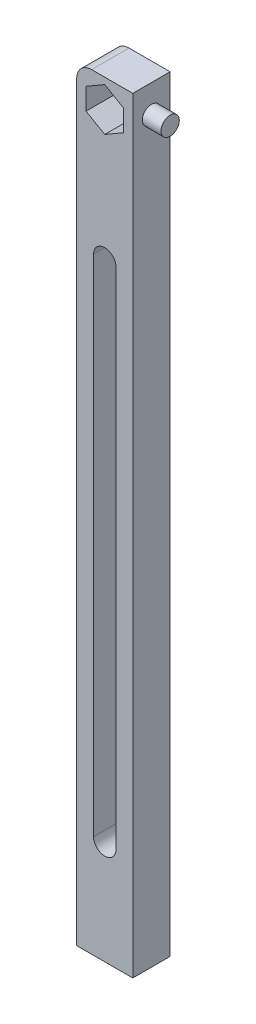
ISO-10303-21;
HEADER;
FILE_DESCRIPTION(('STEP AP214'),'2;1');
FILE_NAME('part.step','',(''),(''),'','','');
FILE_SCHEMA(('AUTOMOTIVE_DESIGN { 1 0 10303 214 1 1 1 1 }'));
ENDSEC;
DATA;
#1=APPLICATION_CONTEXT('core data for automotive mechanical design processes');
#2=APPLICATION_PROTOCOL_DEFINITION('international standard','automotive_design',2000,#1);
#3=PRODUCT_CONTEXT('',#1,'mechanical');
#4=PRODUCT('Part','Part','',(#3));
#5=PRODUCT_RELATED_PRODUCT_CATEGORY('part','',(#4));
#6=PRODUCT_DEFINITION_FORMATION('','',#4);
#7=PRODUCT_DEFINITION_CONTEXT('part definition',#1,'design');
#8=PRODUCT_DEFINITION('design','',#6,#7);
#9=PRODUCT_DEFINITION_SHAPE('','',#8);
#10=(LENGTH_UNIT() NAMED_UNIT(*) SI_UNIT(.MILLI.,.METRE.));
#11=(NAMED_UNIT(*) PLANE_ANGLE_UNIT() SI_UNIT($,.RADIAN.));
#12=(NAMED_UNIT(*) SI_UNIT($,.STERADIAN.) SOLID_ANGLE_UNIT());
#13=UNCERTAINTY_MEASURE_WITH_UNIT(LENGTH_MEASURE(1.E-05),#10,'distance_accuracy_value','');
#14=(GEOMETRIC_REPRESENTATION_CONTEXT(3) GLOBAL_UNCERTAINTY_ASSIGNED_CONTEXT((#13)) GLOBAL_UNIT_ASSIGNED_CONTEXT((#10,
#11,#12)) REPRESENTATION_CONTEXT('',''));
#15=CARTESIAN_POINT('',(0.,0.,0.));
#16=DIRECTION('',(0.,0.,1.));
#17=DIRECTION('',(1.,0.,0.));
#18=AXIS2_PLACEMENT_3D('',#15,#16,#17);
#19=CARTESIAN_POINT('',(0.,0.,10.));
#20=DIRECTION('',(0.,0.,1.));
#21=DIRECTION('',(1.,0.,0.));
#22=AXIS2_PLACEMENT_3D('',#19,#20,#21);
#23=PLANE('',#22);
#24=DIRECTION('',(-1.,0.,0.));
#25=VECTOR('',#24,1.);
#26=CARTESIAN_POINT('',(15.,-205.,10.));
#27=LINE('',#26,#25);
#28=CARTESIAN_POINT('',(15.,-205.,10.));
#29=VERTEX_POINT('',#28);
#30=CARTESIAN_POINT('',(0.,-205.,10.));
#31=VERTEX_POINT('',#30);
#32=EDGE_CURVE('E141',#29,#31,#27,.T.);
#33=ORIENTED_EDGE('',*,*,#32,.F.);
#34=DIRECTION('',(0.,-1.,0.));
#35=VECTOR('',#34,1.);
#36=CARTESIAN_POINT('',(15.,-15.,10.));
#37=LINE('',#36,#35);
#38=CARTESIAN_POINT('',(15.,0.,10.));
#39=VERTEX_POINT('',#38);
#40=EDGE_CURVE('E163',#39,#29,#37,.T.);
#41=ORIENTED_EDGE('',*,*,#40,.F.);
#42=DIRECTION('',(-1.,0.,0.));
#43=VECTOR('',#42,1.);
#44=CARTESIAN_POINT('',(0.,0.,10.));
#45=LINE('',#44,#43);
#46=CARTESIAN_POINT('',(4.,0.,10.));
#47=VERTEX_POINT('',#46);
#48=EDGE_CURVE('E170',#39,#47,#45,.T.);
#49=ORIENTED_EDGE('',*,*,#48,.T.);
#50=CARTESIAN_POINT('',(4.,-4.,10.));
#51=DIRECTION('',(0.,0.,1.));
#52=DIRECTION('',(1.,0.,0.));
#53=AXIS2_PLACEMENT_3D('',#50,#51,#52);
#54=CIRCLE('',#53,4.);
#55=CARTESIAN_POINT('',(0.,-4.,10.));
#56=VERTEX_POINT('',#55);
#57=EDGE_CURVE('E41',#47,#56,#54,.T.);
#58=ORIENTED_EDGE('',*,*,#57,.T.);
#59=DIRECTION('',(0.,-1.,0.));
#60=VECTOR('',#59,1.);
#61=CARTESIAN_POINT('',(0.,0.,10.));
#62=LINE('',#61,#60);
#63=EDGE_CURVE('E165',#56,#31,#62,.T.);
#64=ORIENTED_EDGE('',*,*,#63,.T.);
#65=EDGE_LOOP('',(#33,#41,#49,#58,#64));
#66=FACE_BOUND('',#65,.T.);
#67=CARTESIAN_POINT('',(7.49999999999998,-42.5,10.));
#68=DIRECTION('',(0.,0.,1.));
#69=DIRECTION('',(1.,0.,0.));
#70=AXIS2_PLACEMENT_3D('',#67,#68,#69);
#71=CIRCLE('',#70,3.);
#72=CARTESIAN_POINT('',(10.5,-42.5,10.));
#73=VERTEX_POINT('',#72);
#74=CARTESIAN_POINT('',(4.49999999999998,-42.5,10.));
#75=VERTEX_POINT('',#74);
#76=EDGE_CURVE('E56',#73,#75,#71,.T.);
#77=ORIENTED_EDGE('',*,*,#76,.F.);
#78=DIRECTION('',(0.,1.,0.));
#79=VECTOR('',#78,1.);
#80=CARTESIAN_POINT('',(10.5,-42.5,10.));
#81=LINE('',#80,#79);
#82=CARTESIAN_POINT('',(10.5,-177.5,10.));
#83=VERTEX_POINT('',#82);
#84=EDGE_CURVE('E199',#83,#73,#81,.T.);
#85=ORIENTED_EDGE('',*,*,#84,.F.);
#86=CARTESIAN_POINT('',(7.4999999999999,-177.5,10.));
#87=DIRECTION('',(0.,0.,1.));
#88=DIRECTION('',(1.,0.,0.));
#89=AXIS2_PLACEMENT_3D('',#86,#87,#88);
#90=CIRCLE('',#89,3.);
#91=CARTESIAN_POINT('',(4.4999999999999,-177.5,10.));
#92=VERTEX_POINT('',#91);
#93=EDGE_CURVE('E211',#92,#83,#90,.T.);
#94=ORIENTED_EDGE('',*,*,#93,.F.);
#95=DIRECTION('',(0.,-1.,0.));
#96=VECTOR('',#95,1.);
#97=CARTESIAN_POINT('',(4.49999999999998,-42.5,10.));
#98=LINE('',#97,#96);
#99=EDGE_CURVE('E189',#75,#92,#98,.T.);
#100=ORIENTED_EDGE('',*,*,#99,.F.);
#101=EDGE_LOOP('',(#77,#85,#94,#100));
#102=FACE_BOUND('',#101,.T.);
#103=DIRECTION('',(0.866025403784439,0.499999999999999,0.));
#104=VECTOR('',#103,1.);
#105=CARTESIAN_POINT('',(7.50000000000003,-13.2735026918977,10.));
#106=LINE('',#105,#104);
#107=CARTESIAN_POINT('',(7.50000000000003,-13.2735026918977,10.));
#108=VERTEX_POINT('',#107);
#109=CARTESIAN_POINT('',(12.5,-10.3867513459496,10.));
#110=VERTEX_POINT('',#109);
#111=EDGE_CURVE('E226',#108,#110,#106,.T.);
#112=ORIENTED_EDGE('',*,*,#111,.F.);
#113=DIRECTION('',(0.866025403784439,-0.5,0.));
#114=VECTOR('',#113,1.);
#115=CARTESIAN_POINT('',(2.50000000000003,-10.3867513459496,10.));
#116=LINE('',#115,#114);
#117=CARTESIAN_POINT('',(2.50000000000003,-10.3867513459496,10.));
#118=VERTEX_POINT('',#117);
#119=EDGE_CURVE('E224',#118,#108,#116,.T.);
#120=ORIENTED_EDGE('',*,*,#119,.F.);
#121=DIRECTION('',(0.,-1.,0.));
#122=VECTOR('',#121,1.);
#123=CARTESIAN_POINT('',(2.50000000000003,-4.6132486540533,10.));
#124=LINE('',#123,#122);
#125=CARTESIAN_POINT('',(2.50000000000003,-4.6132486540533,10.));
#126=VERTEX_POINT('',#125);
#127=EDGE_CURVE('E236',#126,#118,#124,.T.);
#128=ORIENTED_EDGE('',*,*,#127,.F.);
#129=DIRECTION('',(-0.866025403784439,-0.5,0.));
#130=VECTOR('',#129,1.);
#131=CARTESIAN_POINT('',(7.50000000000002,-1.72649730810517,10.));
#132=LINE('',#131,#130);
#133=CARTESIAN_POINT('',(7.50000000000002,-1.72649730810517,10.));
#134=VERTEX_POINT('',#133);
#135=EDGE_CURVE('E233',#134,#126,#132,.T.);
#136=ORIENTED_EDGE('',*,*,#135,.F.);
#137=DIRECTION('',(-0.866025403784439,0.5,0.));
#138=VECTOR('',#137,1.);
#139=CARTESIAN_POINT('',(12.5,-4.61324865405331,10.));
#140=LINE('',#139,#138);
#141=CARTESIAN_POINT('',(12.5,-4.61324865405331,10.));
#142=VERTEX_POINT('',#141);
#143=EDGE_CURVE('E231',#142,#134,#140,.T.);
#144=ORIENTED_EDGE('',*,*,#143,.F.);
#145=DIRECTION('',(0.,1.,0.));
#146=VECTOR('',#145,1.);
#147=CARTESIAN_POINT('',(12.5,-10.3867513459496,10.));
#148=LINE('',#147,#146);
#149=EDGE_CURVE('E229',#110,#142,#148,.T.);
#150=ORIENTED_EDGE('',*,*,#149,.F.);
#151=EDGE_LOOP('',(#112,#120,#128,#136,#144,#150));
#152=FACE_BOUND('',#151,.T.);
#153=ADVANCED_FACE('F33',(#66,#102,#152),#23,.T.);
#154=CARTESIAN_POINT('',(0.,0.,0.));
#155=DIRECTION('',(0.,0.,1.));
#156=DIRECTION('',(1.,0.,0.));
#157=AXIS2_PLACEMENT_3D('',#154,#155,#156);
#158=PLANE('',#157);
#159=DIRECTION('',(0.,1.,0.));
#160=VECTOR('',#159,1.);
#161=CARTESIAN_POINT('',(10.5,-42.5,0.));
#162=LINE('',#161,#160);
#163=CARTESIAN_POINT('',(10.5,-177.5,0.));
#164=VERTEX_POINT('',#163);
#165=CARTESIAN_POINT('',(10.5,-42.5,0.));
#166=VERTEX_POINT('',#165);
#167=EDGE_CURVE('E205',#164,#166,#162,.T.);
#168=ORIENTED_EDGE('',*,*,#167,.T.);
#169=CARTESIAN_POINT('',(7.49999999999998,-42.5,0.));
#170=DIRECTION('',(0.,0.,1.));
#171=DIRECTION('',(1.,0.,0.));
#172=AXIS2_PLACEMENT_3D('',#169,#170,#171);
#173=CIRCLE('',#172,3.);
#174=CARTESIAN_POINT('',(4.49999999999998,-42.5,0.));
#175=VERTEX_POINT('',#174);
#176=EDGE_CURVE('E195',#166,#175,#173,.T.);
#177=ORIENTED_EDGE('',*,*,#176,.T.);
#178=DIRECTION('',(0.,-1.,0.));
#179=VECTOR('',#178,1.);
#180=CARTESIAN_POINT('',(4.49999999999998,-42.5,0.));
#181=LINE('',#180,#179);
#182=CARTESIAN_POINT('',(4.5,-177.5,0.));
#183=VERTEX_POINT('',#182);
#184=EDGE_CURVE('E198',#175,#183,#181,.T.);
#185=ORIENTED_EDGE('',*,*,#184,.T.);
#186=CARTESIAN_POINT('',(7.4999999999999,-177.5,0.));
#187=DIRECTION('',(0.,0.,1.));
#188=DIRECTION('',(1.,0.,0.));
#189=AXIS2_PLACEMENT_3D('',#186,#187,#188);
#190=CIRCLE('',#189,3.);
#191=EDGE_CURVE('E202',#183,#164,#190,.T.);
#192=ORIENTED_EDGE('',*,*,#191,.T.);
#193=EDGE_LOOP('',(#168,#177,#185,#192));
#194=FACE_BOUND('',#193,.T.);
#195=DIRECTION('',(0.866025403784439,-0.5,0.));
#196=VECTOR('',#195,1.);
#197=CARTESIAN_POINT('',(2.50000000000003,-10.3867513459496,0.));
#198=LINE('',#197,#196);
#199=CARTESIAN_POINT('',(2.50000000000003,-10.3867513459496,0.));
#200=VERTEX_POINT('',#199);
#201=CARTESIAN_POINT('',(7.50000000000003,-13.2735026918977,0.));
#202=VERTEX_POINT('',#201);
#203=EDGE_CURVE('E218',#200,#202,#198,.T.);
#204=ORIENTED_EDGE('',*,*,#203,.T.);
#205=DIRECTION('',(0.866025403784439,0.499999999999999,0.));
#206=VECTOR('',#205,1.);
#207=CARTESIAN_POINT('',(7.50000000000003,-13.2735026918977,0.));
#208=LINE('',#207,#206);
#209=CARTESIAN_POINT('',(12.5,-10.3867513459496,0.));
#210=VERTEX_POINT('',#209);
#211=EDGE_CURVE('E241',#202,#210,#208,.T.);
#212=ORIENTED_EDGE('',*,*,#211,.T.);
#213=DIRECTION('',(0.,1.,0.));
#214=VECTOR('',#213,1.);
#215=CARTESIAN_POINT('',(12.5,-10.3867513459496,0.));
#216=LINE('',#215,#214);
#217=CARTESIAN_POINT('',(12.5,-4.61324865405331,0.));
#218=VERTEX_POINT('',#217);
#219=EDGE_CURVE('E244',#210,#218,#216,.T.);
#220=ORIENTED_EDGE('',*,*,#219,.T.);
#221=DIRECTION('',(-0.866025403784439,0.5,0.));
#222=VECTOR('',#221,1.);
#223=CARTESIAN_POINT('',(12.5,-4.61324865405331,0.));
#224=LINE('',#223,#222);
#225=CARTESIAN_POINT('',(7.50000000000002,-1.72649730810517,0.));
#226=VERTEX_POINT('',#225);
#227=EDGE_CURVE('E247',#218,#226,#224,.T.);
#228=ORIENTED_EDGE('',*,*,#227,.T.);
#229=DIRECTION('',(-0.866025403784439,-0.5,0.));
#230=VECTOR('',#229,1.);
#231=CARTESIAN_POINT('',(7.50000000000002,-1.72649730810517,0.));
#232=LINE('',#231,#230);
#233=CARTESIAN_POINT('',(2.50000000000003,-4.6132486540533,0.));
#234=VERTEX_POINT('',#233);
#235=EDGE_CURVE('E250',#226,#234,#232,.T.);
#236=ORIENTED_EDGE('',*,*,#235,.T.);
#237=DIRECTION('',(0.,-1.,0.));
#238=VECTOR('',#237,1.);
#239=CARTESIAN_POINT('',(2.50000000000003,-4.6132486540533,0.));
#240=LINE('',#239,#238);
#241=EDGE_CURVE('E227',#234,#200,#240,.T.);
#242=ORIENTED_EDGE('',*,*,#241,.T.);
#243=EDGE_LOOP('',(#204,#212,#220,#228,#236,#242));
#244=FACE_BOUND('',#243,.T.);
#245=DIRECTION('',(0.,-1.,0.));
#246=VECTOR('',#245,1.);
#247=CARTESIAN_POINT('',(15.,-15.,0.));
#248=LINE('',#247,#246);
#249=CARTESIAN_POINT('',(15.,0.,0.));
#250=VERTEX_POINT('',#249);
#251=CARTESIAN_POINT('',(15.,-205.,0.));
#252=VERTEX_POINT('',#251);
#253=EDGE_CURVE('E156',#250,#252,#248,.T.);
#254=ORIENTED_EDGE('',*,*,#253,.T.);
#255=DIRECTION('',(-1.,0.,0.));
#256=VECTOR('',#255,1.);
#257=CARTESIAN_POINT('',(15.,-205.,0.));
#258=LINE('',#257,#256);
#259=CARTESIAN_POINT('',(0.,-205.,0.));
#260=VERTEX_POINT('',#259);
#261=EDGE_CURVE('E48',#252,#260,#258,.T.);
#262=ORIENTED_EDGE('',*,*,#261,.T.);
#263=DIRECTION('',(0.,-1.,0.));
#264=VECTOR('',#263,1.);
#265=CARTESIAN_POINT('',(0.,0.,0.));
#266=LINE('',#265,#264);
#267=CARTESIAN_POINT('',(0.,-4.,0.));
#268=VERTEX_POINT('',#267);
#269=EDGE_CURVE('E154',#268,#260,#266,.T.);
#270=ORIENTED_EDGE('',*,*,#269,.F.);
#271=CARTESIAN_POINT('',(4.,-4.,0.));
#272=DIRECTION('',(0.,0.,1.));
#273=DIRECTION('',(1.,0.,0.));
#274=AXIS2_PLACEMENT_3D('',#271,#272,#273);
#275=CIRCLE('',#274,4.);
#276=CARTESIAN_POINT('',(4.,0.,0.));
#277=VERTEX_POINT('',#276);
#278=EDGE_CURVE('E173',#268,#277,#275,.F.);
#279=ORIENTED_EDGE('',*,*,#278,.T.);
#280=DIRECTION('',(-1.,0.,0.));
#281=VECTOR('',#280,1.);
#282=CARTESIAN_POINT('',(0.,0.,0.));
#283=LINE('',#282,#281);
#284=EDGE_CURVE('E162',#250,#277,#283,.T.);
#285=ORIENTED_EDGE('',*,*,#284,.F.);
#286=EDGE_LOOP('',(#254,#262,#270,#279,#285));
#287=FACE_BOUND('',#286,.T.);
#288=ADVANCED_FACE('F152',(#194,#244,#287),#158,.F.);
#289=CARTESIAN_POINT('',(0.,0.,10.));
#290=DIRECTION('',(1.,0.,0.));
#291=DIRECTION('',(0.,1.,0.));
#292=AXIS2_PLACEMENT_3D('',#289,#290,#291);
#293=PLANE('',#292);
#294=ORIENTED_EDGE('',*,*,#269,.T.);
#295=DIRECTION('',(0.,0.,1.));
#296=VECTOR('',#295,1.);
#297=CARTESIAN_POINT('',(0.,-205.,0.));
#298=LINE('',#297,#296);
#299=EDGE_CURVE('E138',#260,#31,#298,.T.);
#300=ORIENTED_EDGE('',*,*,#299,.T.);
#301=ORIENTED_EDGE('',*,*,#63,.F.);
#302=DIRECTION('',(0.,0.,-1.));
#303=VECTOR('',#302,1.);
#304=CARTESIAN_POINT('',(0.,-4.,10.));
#305=LINE('',#304,#303);
#306=EDGE_CURVE('E161',#56,#268,#305,.T.);
#307=ORIENTED_EDGE('',*,*,#306,.T.);
#308=EDGE_LOOP('',(#294,#300,#301,#307));
#309=FACE_BOUND('',#308,.T.);
#310=ADVANCED_FACE('F159',(#309),#293,.F.);
#311=CARTESIAN_POINT('',(0.,0.,10.));
#312=DIRECTION('',(0.,-1.,0.));
#313=DIRECTION('',(0.,0.,-1.));
#314=AXIS2_PLACEMENT_3D('',#311,#312,#313);
#315=PLANE('',#314);
#316=ORIENTED_EDGE('',*,*,#48,.F.);
#317=DIRECTION('',(0.,0.,1.));
#318=VECTOR('',#317,1.);
#319=CARTESIAN_POINT('',(15.,0.,0.));
#320=LINE('',#319,#318);
#321=EDGE_CURVE('E185',#250,#39,#320,.T.);
#322=ORIENTED_EDGE('',*,*,#321,.F.);
#323=ORIENTED_EDGE('',*,*,#284,.T.);
#324=DIRECTION('',(0.,0.,-1.));
#325=VECTOR('',#324,1.);
#326=CARTESIAN_POINT('',(4.,0.,10.));
#327=LINE('',#326,#325);
#328=EDGE_CURVE('E11',#277,#47,#327,.F.);
#329=ORIENTED_EDGE('',*,*,#328,.T.);
#330=EDGE_LOOP('',(#316,#322,#323,#329));
#331=FACE_BOUND('',#330,.T.);
#332=ADVANCED_FACE('F183',(#331),#315,.F.);
#333=CARTESIAN_POINT('',(15.,-15.,10.));
#334=DIRECTION('',(1.,0.,0.));
#335=DIRECTION('',(0.,1.,0.));
#336=AXIS2_PLACEMENT_3D('',#333,#334,#335);
#337=PLANE('',#336);
#338=DIRECTION('',(0.,0.,1.));
#339=VECTOR('',#338,1.);
#340=CARTESIAN_POINT('',(15.,-205.,0.));
#341=LINE('',#340,#339);
#342=EDGE_CURVE('E147',#252,#29,#341,.T.);
#343=ORIENTED_EDGE('',*,*,#342,.F.);
#344=ORIENTED_EDGE('',*,*,#253,.F.);
#345=ORIENTED_EDGE('',*,*,#321,.T.);
#346=ORIENTED_EDGE('',*,*,#40,.T.);
#347=EDGE_LOOP('',(#343,#344,#345,#346));
#348=FACE_BOUND('',#347,.T.);
#349=CARTESIAN_POINT('',(15.,-7.5,5.));
#350=DIRECTION('',(1.,0.,0.));
#351=DIRECTION('',(0.,1.,0.));
#352=AXIS2_PLACEMENT_3D('',#349,#350,#351);
#353=CIRCLE('',#352,2.45);
#354=CARTESIAN_POINT('',(15.,-5.05,5.));
#355=VERTEX_POINT('',#354);
#356=EDGE_CURVE('E146',#355,#355,#353,.T.);
#357=ORIENTED_EDGE('',*,*,#356,.F.);
#358=EDGE_LOOP('',(#357));
#359=FACE_BOUND('',#358,.T.);
#360=ADVANCED_FACE('F313',(#348,#359),#337,.T.);
#361=CARTESIAN_POINT('',(2.50000000000003,-10.3867513459496,10.));
#362=DIRECTION('',(0.5,0.866025403784439,0.));
#363=DIRECTION('',(-0.866025403784439,0.5,0.));
#364=AXIS2_PLACEMENT_3D('',#361,#362,#363);
#365=PLANE('',#364);
#366=ORIENTED_EDGE('',*,*,#203,.F.);
#367=DIRECTION('',(0.,0.,-1.));
#368=VECTOR('',#367,1.);
#369=CARTESIAN_POINT('',(2.50000000000003,-10.3867513459496,10.));
#370=LINE('',#369,#368);
#371=EDGE_CURVE('E238',#118,#200,#370,.T.);
#372=ORIENTED_EDGE('',*,*,#371,.F.);
#373=ORIENTED_EDGE('',*,*,#119,.T.);
#374=DIRECTION('',(0.,0.,-1.));
#375=VECTOR('',#374,1.);
#376=CARTESIAN_POINT('',(7.50000000000003,-13.2735026918977,10.));
#377=LINE('',#376,#375);
#378=EDGE_CURVE('E265',#108,#202,#377,.T.);
#379=ORIENTED_EDGE('',*,*,#378,.T.);
#380=EDGE_LOOP('',(#366,#372,#373,#379));
#381=FACE_BOUND('',#380,.T.);
#382=ADVANCED_FACE('F270',(#381),#365,.T.);
#383=CARTESIAN_POINT('',(7.50000000000003,-13.2735026918977,10.));
#384=DIRECTION('',(-0.5,0.866025403784439,0.));
#385=DIRECTION('',(-0.866025403784439,-0.5,0.));
#386=AXIS2_PLACEMENT_3D('',#383,#384,#385);
#387=PLANE('',#386);
#388=ORIENTED_EDGE('',*,*,#211,.F.);
#389=ORIENTED_EDGE('',*,*,#378,.F.);
#390=ORIENTED_EDGE('',*,*,#111,.T.);
#391=DIRECTION('',(0.,0.,-1.));
#392=VECTOR('',#391,1.);
#393=CARTESIAN_POINT('',(12.5,-10.3867513459496,10.));
#394=LINE('',#393,#392);
#395=EDGE_CURVE('E263',#110,#210,#394,.T.);
#396=ORIENTED_EDGE('',*,*,#395,.T.);
#397=EDGE_LOOP('',(#388,#389,#390,#396));
#398=FACE_BOUND('',#397,.T.);
#399=ADVANCED_FACE('F286',(#398),#387,.T.);
#400=CARTESIAN_POINT('',(12.5,-10.3867513459496,10.));
#401=DIRECTION('',(-1.,0.,0.));
#402=DIRECTION('',(0.,0.,1.));
#403=AXIS2_PLACEMENT_3D('',#400,#401,#402);
#404=PLANE('',#403);
#405=ORIENTED_EDGE('',*,*,#219,.F.);
#406=ORIENTED_EDGE('',*,*,#395,.F.);
#407=ORIENTED_EDGE('',*,*,#149,.T.);
#408=DIRECTION('',(0.,0.,-1.));
#409=VECTOR('',#408,1.);
#410=CARTESIAN_POINT('',(12.5,-4.61324865405331,10.));
#411=LINE('',#410,#409);
#412=EDGE_CURVE('E261',#142,#218,#411,.T.);
#413=ORIENTED_EDGE('',*,*,#412,.T.);
#414=EDGE_LOOP('',(#405,#406,#407,#413));
#415=FACE_BOUND('',#414,.T.);
#416=ADVANCED_FACE('F289',(#415),#404,.T.);
#417=CARTESIAN_POINT('',(12.5,-4.61324865405331,10.));
#418=DIRECTION('',(-0.5,-0.866025403784439,0.));
#419=DIRECTION('',(0.866025403784439,-0.5,0.));
#420=AXIS2_PLACEMENT_3D('',#417,#418,#419);
#421=PLANE('',#420);
#422=ORIENTED_EDGE('',*,*,#227,.F.);
#423=ORIENTED_EDGE('',*,*,#412,.F.);
#424=ORIENTED_EDGE('',*,*,#143,.T.);
#425=DIRECTION('',(0.,0.,-1.));
#426=VECTOR('',#425,1.);
#427=CARTESIAN_POINT('',(7.50000000000002,-1.72649730810517,10.));
#428=LINE('',#427,#426);
#429=EDGE_CURVE('E259',#134,#226,#428,.T.);
#430=ORIENTED_EDGE('',*,*,#429,.T.);
#431=EDGE_LOOP('',(#422,#423,#424,#430));
#432=FACE_BOUND('',#431,.T.);
#433=ADVANCED_FACE('F293',(#432),#421,.T.);
#434=CARTESIAN_POINT('',(7.50000000000002,-1.72649730810517,10.));
#435=DIRECTION('',(0.5,-0.866025403784439,0.));
#436=DIRECTION('',(0.866025403784439,0.5,0.));
#437=AXIS2_PLACEMENT_3D('',#434,#435,#436);
#438=PLANE('',#437);
#439=ORIENTED_EDGE('',*,*,#235,.F.);
#440=ORIENTED_EDGE('',*,*,#429,.F.);
#441=ORIENTED_EDGE('',*,*,#135,.T.);
#442=DIRECTION('',(0.,0.,-1.));
#443=VECTOR('',#442,1.);
#444=CARTESIAN_POINT('',(2.50000000000003,-4.6132486540533,10.));
#445=LINE('',#444,#443);
#446=EDGE_CURVE('E257',#126,#234,#445,.T.);
#447=ORIENTED_EDGE('',*,*,#446,.T.);
#448=EDGE_LOOP('',(#439,#440,#441,#447));
#449=FACE_BOUND('',#448,.T.);
#450=ADVANCED_FACE('F296',(#449),#438,.T.);
#451=CARTESIAN_POINT('',(2.50000000000003,-4.6132486540533,10.));
#452=DIRECTION('',(1.,0.,0.));
#453=DIRECTION('',(0.,0.,-1.));
#454=AXIS2_PLACEMENT_3D('',#451,#452,#453);
#455=PLANE('',#454);
#456=ORIENTED_EDGE('',*,*,#241,.F.);
#457=ORIENTED_EDGE('',*,*,#446,.F.);
#458=ORIENTED_EDGE('',*,*,#127,.T.);
#459=ORIENTED_EDGE('',*,*,#371,.T.);
#460=EDGE_LOOP('',(#456,#457,#458,#459));
#461=FACE_BOUND('',#460,.T.);
#462=ADVANCED_FACE('F279',(#461),#455,.T.);
#463=CARTESIAN_POINT('',(4.,-4.,10.));
#464=DIRECTION('',(0.,0.,-1.));
#465=DIRECTION('',(-1.,0.,0.));
#466=AXIS2_PLACEMENT_3D('',#463,#464,#465);
#467=CYLINDRICAL_SURFACE('',#466,4.);
#468=ORIENTED_EDGE('',*,*,#57,.F.);
#469=ORIENTED_EDGE('',*,*,#328,.F.);
#470=ORIENTED_EDGE('',*,*,#278,.F.);
#471=ORIENTED_EDGE('',*,*,#306,.F.);
#472=EDGE_LOOP('',(#468,#469,#470,#471));
#473=FACE_BOUND('',#472,.T.);
#474=ADVANCED_FACE('F35',(#473),#467,.T.);
#475=CARTESIAN_POINT('',(7.49999999999998,-42.5,0.));
#476=DIRECTION('',(0.,0.,1.));
#477=DIRECTION('',(1.,0.,0.));
#478=AXIS2_PLACEMENT_3D('',#475,#476,#477);
#479=CYLINDRICAL_SURFACE('',#478,3.);
#480=ORIENTED_EDGE('',*,*,#76,.T.);
#481=DIRECTION('',(0.,0.,1.));
#482=VECTOR('',#481,1.);
#483=CARTESIAN_POINT('',(4.49999999999998,-42.5,0.));
#484=LINE('',#483,#482);
#485=EDGE_CURVE('E207',#175,#75,#484,.T.);
#486=ORIENTED_EDGE('',*,*,#485,.F.);
#487=ORIENTED_EDGE('',*,*,#176,.F.);
#488=DIRECTION('',(0.,0.,1.));
#489=VECTOR('',#488,1.);
#490=CARTESIAN_POINT('',(10.5,-42.5,0.));
#491=LINE('',#490,#489);
#492=EDGE_CURVE('E216',#166,#73,#491,.T.);
#493=ORIENTED_EDGE('',*,*,#492,.T.);
#494=EDGE_LOOP('',(#480,#486,#487,#493));
#495=FACE_BOUND('',#494,.T.);
#496=ADVANCED_FACE('F374',(#495),#479,.F.);
#497=CARTESIAN_POINT('',(10.5,-42.5,0.));
#498=DIRECTION('',(1.,0.,0.));
#499=DIRECTION('',(0.,1.,0.));
#500=AXIS2_PLACEMENT_3D('',#497,#498,#499);
#501=PLANE('',#500);
#502=ORIENTED_EDGE('',*,*,#84,.T.);
#503=ORIENTED_EDGE('',*,*,#492,.F.);
#504=ORIENTED_EDGE('',*,*,#167,.F.);
#505=DIRECTION('',(0.,0.,1.));
#506=VECTOR('',#505,1.);
#507=CARTESIAN_POINT('',(10.5,-177.5,0.));
#508=LINE('',#507,#506);
#509=EDGE_CURVE('E219',#164,#83,#508,.T.);
#510=ORIENTED_EDGE('',*,*,#509,.T.);
#511=EDGE_LOOP('',(#502,#503,#504,#510));
#512=FACE_BOUND('',#511,.T.);
#513=ADVANCED_FACE('F382',(#512),#501,.F.);
#514=CARTESIAN_POINT('',(7.4999999999999,-177.5,0.));
#515=DIRECTION('',(0.,0.,1.));
#516=DIRECTION('',(1.,0.,0.));
#517=AXIS2_PLACEMENT_3D('',#514,#515,#516);
#518=CYLINDRICAL_SURFACE('',#517,3.);
#519=ORIENTED_EDGE('',*,*,#93,.T.);
#520=ORIENTED_EDGE('',*,*,#509,.F.);
#521=ORIENTED_EDGE('',*,*,#191,.F.);
#522=DIRECTION('',(0.,0.,1.));
#523=VECTOR('',#522,1.);
#524=CARTESIAN_POINT('',(4.4999999999999,-177.5,0.));
#525=LINE('',#524,#523);
#526=EDGE_CURVE('E221',#183,#92,#525,.T.);
#527=ORIENTED_EDGE('',*,*,#526,.T.);
#528=EDGE_LOOP('',(#519,#520,#521,#527));
#529=FACE_BOUND('',#528,.T.);
#530=ADVANCED_FACE('F391',(#529),#518,.F.);
#531=CARTESIAN_POINT('',(4.49999999999998,-42.5,0.));
#532=DIRECTION('',(-1.,0.,0.));
#533=DIRECTION('',(0.,-1.,0.));
#534=AXIS2_PLACEMENT_3D('',#531,#532,#533);
#535=PLANE('',#534);
#536=ORIENTED_EDGE('',*,*,#99,.T.);
#537=ORIENTED_EDGE('',*,*,#526,.F.);
#538=ORIENTED_EDGE('',*,*,#184,.F.);
#539=ORIENTED_EDGE('',*,*,#485,.T.);
#540=EDGE_LOOP('',(#536,#537,#538,#539));
#541=FACE_BOUND('',#540,.T.);
#542=ADVANCED_FACE('F400',(#541),#535,.F.);
#543=CARTESIAN_POINT('',(20.,-7.5,5.));
#544=DIRECTION('',(-1.,0.,0.));
#545=DIRECTION('',(0.,-1.,0.));
#546=AXIS2_PLACEMENT_3D('',#543,#544,#545);
#547=CYLINDRICAL_SURFACE('',#546,2.45);
#548=CARTESIAN_POINT('',(20.,-7.5,5.));
#549=DIRECTION('',(1.,0.,0.));
#550=DIRECTION('',(0.,1.,0.));
#551=AXIS2_PLACEMENT_3D('',#548,#549,#550);
#552=CIRCLE('',#551,2.45);
#553=CARTESIAN_POINT('',(20.,-5.05,5.));
#554=VERTEX_POINT('',#553);
#555=EDGE_CURVE('E187',#554,#554,#552,.T.);
#556=ORIENTED_EDGE('',*,*,#555,.F.);
#557=EDGE_LOOP('',(#556));
#558=FACE_BOUND('',#557,.T.);
#559=ORIENTED_EDGE('',*,*,#356,.T.);
#560=EDGE_LOOP('',(#559));
#561=FACE_BOUND('',#560,.T.);
#562=ADVANCED_FACE('F409',(#558,#561),#547,.T.);
#563=CARTESIAN_POINT('',(20.,-7.5,5.));
#564=DIRECTION('',(1.,0.,0.));
#565=DIRECTION('',(0.,1.,0.));
#566=AXIS2_PLACEMENT_3D('',#563,#564,#565);
#567=PLANE('',#566);
#568=ORIENTED_EDGE('',*,*,#555,.T.);
#569=EDGE_LOOP('',(#568));
#570=FACE_BOUND('',#569,.T.);
#571=ADVANCED_FACE('F418',(#570),#567,.T.);
#572=CARTESIAN_POINT('',(15.,-205.,0.));
#573=DIRECTION('',(0.,1.,0.));
#574=DIRECTION('',(0.,0.,1.));
#575=AXIS2_PLACEMENT_3D('',#572,#573,#574);
#576=PLANE('',#575);
#577=CARTESIAN_POINT('',(7.5,-205.,5.));
#578=DIRECTION('',(0.,-1.,0.));
#579=DIRECTION('',(0.,0.,-1.));
#580=AXIS2_PLACEMENT_3D('',#577,#578,#579);
#581=CIRCLE('',#580,2.5);
#582=CARTESIAN_POINT('',(7.5,-205.,2.5));
#583=VERTEX_POINT('',#582);
#584=EDGE_CURVE('E487',#583,#583,#581,.T.);
#585=ORIENTED_EDGE('',*,*,#584,.F.);
#586=EDGE_LOOP('',(#585));
#587=FACE_BOUND('',#586,.T.);
#588=ORIENTED_EDGE('',*,*,#32,.T.);
#589=ORIENTED_EDGE('',*,*,#299,.F.);
#590=ORIENTED_EDGE('',*,*,#261,.F.);
#591=ORIENTED_EDGE('',*,*,#342,.T.);
#592=EDGE_LOOP('',(#588,#589,#590,#591));
#593=FACE_BOUND('',#592,.T.);
#594=ADVANCED_FACE('F139',(#587,#593),#576,.F.);
#595=CARTESIAN_POINT('',(7.5,-199.,5.));
#596=DIRECTION('',(0.,-1.,0.));
#597=DIRECTION('',(0.,0.,-1.));
#598=AXIS2_PLACEMENT_3D('',#595,#596,#597);
#599=CYLINDRICAL_SURFACE('',#598,2.5);
#600=CARTESIAN_POINT('',(7.5,-199.,5.));
#601=DIRECTION('',(0.,-1.,0.));
#602=DIRECTION('',(0.,0.,-1.));
#603=AXIS2_PLACEMENT_3D('',#600,#601,#602);
#604=CIRCLE('',#603,2.5);
#605=CARTESIAN_POINT('',(7.5,-199.,2.5));
#606=VERTEX_POINT('',#605);
#607=EDGE_CURVE('E486',#606,#606,#604,.T.);
#608=ORIENTED_EDGE('',*,*,#607,.F.);
#609=EDGE_LOOP('',(#608));
#610=FACE_BOUND('',#609,.T.);
#611=ORIENTED_EDGE('',*,*,#584,.T.);
#612=EDGE_LOOP('',(#611));
#613=FACE_BOUND('',#612,.T.);
#614=ADVANCED_FACE('F432',(#610,#613),#599,.F.);
#615=CARTESIAN_POINT('',(7.5,-199.,5.));
#616=DIRECTION('',(0.,-1.,0.));
#617=DIRECTION('',(0.,0.,-1.));
#618=AXIS2_PLACEMENT_3D('',#615,#616,#617);
#619=PLANE('',#618);
#620=ORIENTED_EDGE('',*,*,#607,.T.);
#621=EDGE_LOOP('',(#620));
#622=FACE_BOUND('',#621,.T.);
#623=ADVANCED_FACE('F440',(#622),#619,.T.);
#624=CLOSED_SHELL('',(#153,#288,#310,#332,#360,#382,#399,#416,#433,#450,#462,#474,#496,#513,
#530,#542,#562,#571,#594,#614,#623));
#625=MANIFOLD_SOLID_BREP('B2',#624);
#626=ADVANCED_BREP_SHAPE_REPRESENTATION('',(#18,#625),#14);
#627=SHAPE_DEFINITION_REPRESENTATION(#9,#626);
ENDSEC;
END-ISO-10303-21;
